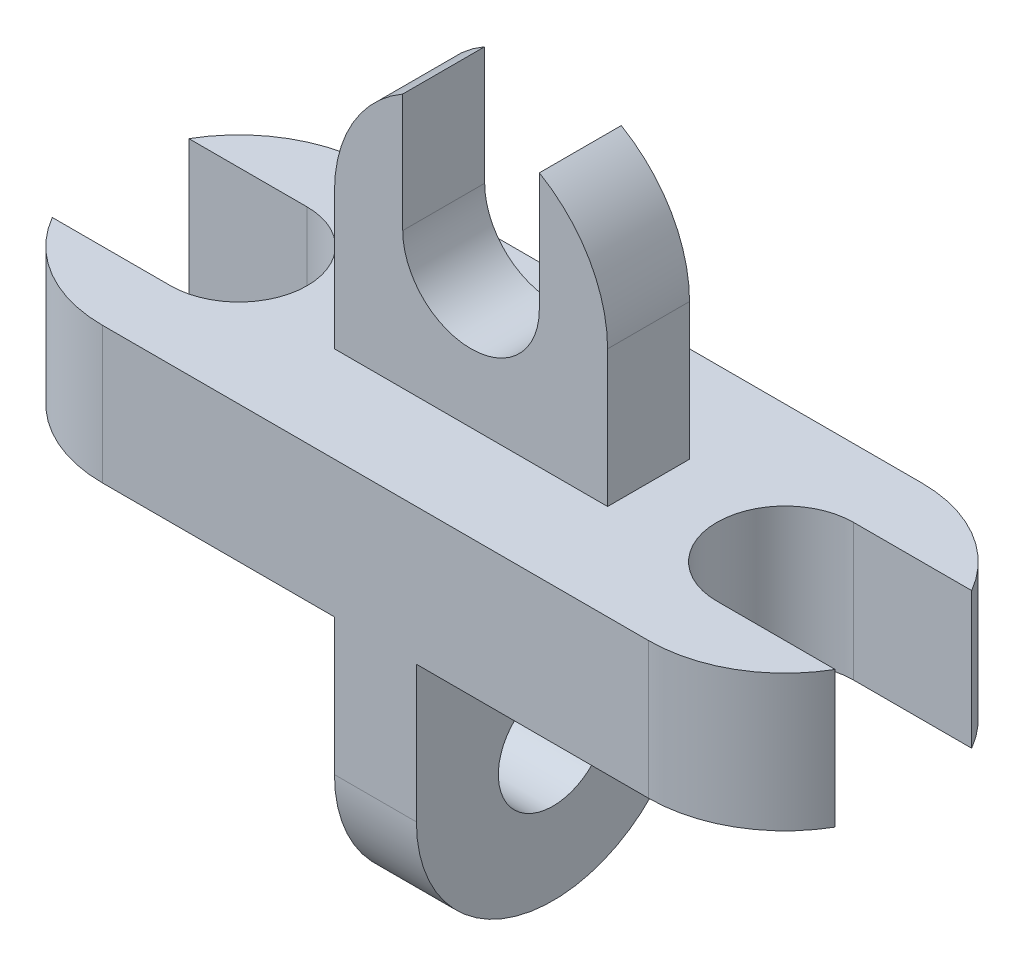
ISO-10303-21;
HEADER;
FILE_DESCRIPTION(('STEP AP214'),'2;1');
FILE_NAME('part.step','',(''),(''),'','','');
FILE_SCHEMA(('AUTOMOTIVE_DESIGN { 1 0 10303 214 1 1 1 1 }'));
ENDSEC;
DATA;
#1=APPLICATION_CONTEXT('core data for automotive mechanical design processes');
#2=APPLICATION_PROTOCOL_DEFINITION('international standard','automotive_design',2000,#1);
#3=PRODUCT_CONTEXT('',#1,'mechanical');
#4=PRODUCT('Part','Part','',(#3));
#5=PRODUCT_RELATED_PRODUCT_CATEGORY('part','',(#4));
#6=PRODUCT_DEFINITION_FORMATION('','',#4);
#7=PRODUCT_DEFINITION_CONTEXT('part definition',#1,'design');
#8=PRODUCT_DEFINITION('design','',#6,#7);
#9=PRODUCT_DEFINITION_SHAPE('','',#8);
#10=(LENGTH_UNIT() NAMED_UNIT(*) SI_UNIT(.MILLI.,.METRE.));
#11=(NAMED_UNIT(*) PLANE_ANGLE_UNIT() SI_UNIT($,.RADIAN.));
#12=(NAMED_UNIT(*) SI_UNIT($,.STERADIAN.) SOLID_ANGLE_UNIT());
#13=UNCERTAINTY_MEASURE_WITH_UNIT(LENGTH_MEASURE(1.E-05),#10,'distance_accuracy_value','');
#14=(GEOMETRIC_REPRESENTATION_CONTEXT(3) GLOBAL_UNCERTAINTY_ASSIGNED_CONTEXT((#13)) GLOBAL_UNIT_ASSIGNED_CONTEXT((#10,
#11,#12)) REPRESENTATION_CONTEXT('',''));
#15=CARTESIAN_POINT('',(0.,0.,0.));
#16=DIRECTION('',(0.,0.,1.));
#17=DIRECTION('',(1.,0.,0.));
#18=AXIS2_PLACEMENT_3D('',#15,#16,#17);
#19=CARTESIAN_POINT('',(-100.,-25.,0.));
#20=DIRECTION('',(0.,-1.,0.));
#21=DIRECTION('',(0.,0.,-1.));
#22=AXIS2_PLACEMENT_3D('',#19,#20,#21);
#23=PLANE('',#22);
#24=DIRECTION('',(1.,0.,0.));
#25=VECTOR('',#24,1.);
#26=CARTESIAN_POINT('',(100.,-25.,50.));
#27=LINE('',#26,#25);
#28=CARTESIAN_POINT('',(15.,-25.,50.));
#29=VERTEX_POINT('',#28);
#30=CARTESIAN_POINT('',(100.,-25.,50.));
#31=VERTEX_POINT('',#30);
#32=EDGE_CURVE('E208',#29,#31,#27,.T.);
#33=ORIENTED_EDGE('',*,*,#32,.F.);
#34=DIRECTION('',(0.,0.,-1.));
#35=VECTOR('',#34,1.);
#36=CARTESIAN_POINT('',(15.,-25.,50.));
#37=LINE('',#36,#35);
#38=CARTESIAN_POINT('',(15.,-25.,-50.));
#39=VERTEX_POINT('',#38);
#40=EDGE_CURVE('E195',#29,#39,#37,.T.);
#41=ORIENTED_EDGE('',*,*,#40,.T.);
#42=DIRECTION('',(-1.,0.,0.));
#43=VECTOR('',#42,1.);
#44=CARTESIAN_POINT('',(100.,-25.,-50.));
#45=LINE('',#44,#43);
#46=CARTESIAN_POINT('',(100.,-25.,-50.));
#47=VERTEX_POINT('',#46);
#48=EDGE_CURVE('E235',#47,#39,#45,.T.);
#49=ORIENTED_EDGE('',*,*,#48,.F.);
#50=CARTESIAN_POINT('',(100.,-25.,0.));
#51=DIRECTION('',(0.,1.,0.));
#52=DIRECTION('',(0.,0.,1.));
#53=AXIS2_PLACEMENT_3D('',#50,#51,#52);
#54=CIRCLE('',#53,50.);
#55=CARTESIAN_POINT('',(143.301270189222,-25.,-25.));
#56=VERTEX_POINT('',#55);
#57=EDGE_CURVE('E232',#56,#47,#54,.T.);
#58=ORIENTED_EDGE('',*,*,#57,.F.);
#59=DIRECTION('',(1.,0.,0.));
#60=VECTOR('',#59,1.);
#61=CARTESIAN_POINT('',(100.,-25.,-25.));
#62=LINE('',#61,#60);
#63=CARTESIAN_POINT('',(100.,-25.,-25.));
#64=VERTEX_POINT('',#63);
#65=EDGE_CURVE('E230',#64,#56,#62,.T.);
#66=ORIENTED_EDGE('',*,*,#65,.F.);
#67=CARTESIAN_POINT('',(100.,-25.,0.));
#68=DIRECTION('',(0.,-1.,0.));
#69=DIRECTION('',(0.,0.,1.));
#70=AXIS2_PLACEMENT_3D('',#67,#68,#69);
#71=CIRCLE('',#70,25.);
#72=CARTESIAN_POINT('',(100.,-25.,25.));
#73=VERTEX_POINT('',#72);
#74=EDGE_CURVE('E228',#73,#64,#71,.T.);
#75=ORIENTED_EDGE('',*,*,#74,.F.);
#76=DIRECTION('',(-1.,0.,0.));
#77=VECTOR('',#76,1.);
#78=CARTESIAN_POINT('',(100.,-25.,25.));
#79=LINE('',#78,#77);
#80=CARTESIAN_POINT('',(143.301270189222,-25.,25.));
#81=VERTEX_POINT('',#80);
#82=EDGE_CURVE('E226',#81,#73,#79,.T.);
#83=ORIENTED_EDGE('',*,*,#82,.F.);
#84=CARTESIAN_POINT('',(100.,-25.,0.));
#85=DIRECTION('',(0.,1.,0.));
#86=DIRECTION('',(0.,0.,1.));
#87=AXIS2_PLACEMENT_3D('',#84,#85,#86);
#88=CIRCLE('',#87,50.);
#89=EDGE_CURVE('E217',#31,#81,#88,.T.);
#90=ORIENTED_EDGE('',*,*,#89,.F.);
#91=EDGE_LOOP('',(#33,#41,#49,#58,#66,#75,#83,#90));
#92=FACE_BOUND('',#91,.T.);
#93=ADVANCED_FACE('F35',(#92),#23,.T.);
#94=CARTESIAN_POINT('',(50.,175.,15.));
#95=DIRECTION('',(-1.,0.,0.));
#96=DIRECTION('',(0.,0.,1.));
#97=AXIS2_PLACEMENT_3D('',#94,#95,#96);
#98=PLANE('',#97);
#99=DIRECTION('',(0.,0.,1.));
#100=VECTOR('',#99,1.);
#101=CARTESIAN_POINT('',(50.,75.,-135.));
#102=LINE('',#101,#100);
#103=CARTESIAN_POINT('',(50.,75.,-15.));
#104=VERTEX_POINT('',#103);
#105=CARTESIAN_POINT('',(50.,75.,15.));
#106=VERTEX_POINT('',#105);
#107=EDGE_CURVE('E353',#104,#106,#102,.T.);
#108=ORIENTED_EDGE('',*,*,#107,.T.);
#109=DIRECTION('',(0.,-1.,0.));
#110=VECTOR('',#109,1.);
#111=CARTESIAN_POINT('',(50.,175.,15.));
#112=LINE('',#111,#110);
#113=CARTESIAN_POINT('',(50.,25.,15.));
#114=VERTEX_POINT('',#113);
#115=EDGE_CURVE('E318',#106,#114,#112,.T.);
#116=ORIENTED_EDGE('',*,*,#115,.T.);
#117=DIRECTION('',(0.,0.,-1.));
#118=VECTOR('',#117,1.);
#119=CARTESIAN_POINT('',(50.,25.,15.));
#120=LINE('',#119,#118);
#121=CARTESIAN_POINT('',(50.,25.,-15.));
#122=VERTEX_POINT('',#121);
#123=EDGE_CURVE('E329',#114,#122,#120,.T.);
#124=ORIENTED_EDGE('',*,*,#123,.T.);
#125=DIRECTION('',(0.,-1.,0.));
#126=VECTOR('',#125,1.);
#127=CARTESIAN_POINT('',(50.,175.,-15.));
#128=LINE('',#127,#126);
#129=EDGE_CURVE('E290',#104,#122,#128,.T.);
#130=ORIENTED_EDGE('',*,*,#129,.F.);
#131=EDGE_LOOP('',(#108,#116,#124,#130));
#132=FACE_BOUND('',#131,.T.);
#133=ADVANCED_FACE('F415',(#132),#98,.F.);
#134=CARTESIAN_POINT('',(-100.,25.,0.));
#135=DIRECTION('',(0.,-1.,0.));
#136=DIRECTION('',(0.,0.,-1.));
#137=AXIS2_PLACEMENT_3D('',#134,#135,#136);
#138=PLANE('',#137);
#139=CARTESIAN_POINT('',(-100.,25.,0.));
#140=DIRECTION('',(0.,1.,0.));
#141=DIRECTION('',(0.,0.,-1.));
#142=AXIS2_PLACEMENT_3D('',#139,#140,#141);
#143=CIRCLE('',#142,50.);
#144=CARTESIAN_POINT('',(-100.,25.,-50.));
#145=VERTEX_POINT('',#144);
#146=CARTESIAN_POINT('',(-143.301270189222,25.,-25.));
#147=VERTEX_POINT('',#146);
#148=EDGE_CURVE('E237',#145,#147,#143,.T.);
#149=ORIENTED_EDGE('',*,*,#148,.T.);
#150=DIRECTION('',(1.,0.,0.));
#151=VECTOR('',#150,1.);
#152=CARTESIAN_POINT('',(-100.,25.,-25.));
#153=LINE('',#152,#151);
#154=CARTESIAN_POINT('',(-100.,25.,-25.));
#155=VERTEX_POINT('',#154);
#156=EDGE_CURVE('E309',#147,#155,#153,.T.);
#157=ORIENTED_EDGE('',*,*,#156,.T.);
#158=CARTESIAN_POINT('',(-100.,25.,0.));
#159=DIRECTION('',(0.,-1.,0.));
#160=DIRECTION('',(0.,0.,-1.));
#161=AXIS2_PLACEMENT_3D('',#158,#159,#160);
#162=CIRCLE('',#161,25.);
#163=CARTESIAN_POINT('',(-100.,25.,25.));
#164=VERTEX_POINT('',#163);
#165=EDGE_CURVE('E275',#155,#164,#162,.T.);
#166=ORIENTED_EDGE('',*,*,#165,.T.);
#167=DIRECTION('',(-1.,0.,0.));
#168=VECTOR('',#167,1.);
#169=CARTESIAN_POINT('',(-100.,25.,25.));
#170=LINE('',#169,#168);
#171=CARTESIAN_POINT('',(-143.301270189222,25.,25.));
#172=VERTEX_POINT('',#171);
#173=EDGE_CURVE('E306',#164,#172,#170,.T.);
#174=ORIENTED_EDGE('',*,*,#173,.T.);
#175=CARTESIAN_POINT('',(-100.,25.,0.));
#176=DIRECTION('',(0.,1.,0.));
#177=DIRECTION('',(0.,0.,-1.));
#178=AXIS2_PLACEMENT_3D('',#175,#176,#177);
#179=CIRCLE('',#178,50.);
#180=CARTESIAN_POINT('',(-100.,25.,50.));
#181=VERTEX_POINT('',#180);
#182=EDGE_CURVE('E304',#172,#181,#179,.T.);
#183=ORIENTED_EDGE('',*,*,#182,.T.);
#184=DIRECTION('',(1.,0.,0.));
#185=VECTOR('',#184,1.);
#186=CARTESIAN_POINT('',(100.,25.,50.));
#187=LINE('',#186,#185);
#188=CARTESIAN_POINT('',(100.,25.,50.));
#189=VERTEX_POINT('',#188);
#190=EDGE_CURVE('E302',#181,#189,#187,.T.);
#191=ORIENTED_EDGE('',*,*,#190,.T.);
#192=CARTESIAN_POINT('',(100.,25.,0.));
#193=DIRECTION('',(0.,1.,0.));
#194=DIRECTION('',(0.,0.,1.));
#195=AXIS2_PLACEMENT_3D('',#192,#193,#194);
#196=CIRCLE('',#195,50.);
#197=CARTESIAN_POINT('',(143.301270189222,25.,25.));
#198=VERTEX_POINT('',#197);
#199=EDGE_CURVE('E300',#189,#198,#196,.T.);
#200=ORIENTED_EDGE('',*,*,#199,.T.);
#201=DIRECTION('',(-1.,0.,0.));
#202=VECTOR('',#201,1.);
#203=CARTESIAN_POINT('',(100.,25.,25.));
#204=LINE('',#203,#202);
#205=CARTESIAN_POINT('',(100.,25.,25.));
#206=VERTEX_POINT('',#205);
#207=EDGE_CURVE('E298',#198,#206,#204,.T.);
#208=ORIENTED_EDGE('',*,*,#207,.T.);
#209=CARTESIAN_POINT('',(100.,25.,0.));
#210=DIRECTION('',(0.,-1.,0.));
#211=DIRECTION('',(0.,0.,1.));
#212=AXIS2_PLACEMENT_3D('',#209,#210,#211);
#213=CIRCLE('',#212,25.);
#214=CARTESIAN_POINT('',(100.,25.,-25.));
#215=VERTEX_POINT('',#214);
#216=EDGE_CURVE('E296',#206,#215,#213,.T.);
#217=ORIENTED_EDGE('',*,*,#216,.T.);
#218=DIRECTION('',(1.,0.,0.));
#219=VECTOR('',#218,1.);
#220=CARTESIAN_POINT('',(100.,25.,-25.));
#221=LINE('',#220,#219);
#222=CARTESIAN_POINT('',(143.301270189222,25.,-25.));
#223=VERTEX_POINT('',#222);
#224=EDGE_CURVE('E294',#215,#223,#221,.T.);
#225=ORIENTED_EDGE('',*,*,#224,.T.);
#226=CARTESIAN_POINT('',(100.,25.,0.));
#227=DIRECTION('',(0.,1.,0.));
#228=DIRECTION('',(0.,0.,1.));
#229=AXIS2_PLACEMENT_3D('',#226,#227,#228);
#230=CIRCLE('',#229,50.);
#231=CARTESIAN_POINT('',(100.,25.,-50.));
#232=VERTEX_POINT('',#231);
#233=EDGE_CURVE('E292',#223,#232,#230,.T.);
#234=ORIENTED_EDGE('',*,*,#233,.T.);
#235=DIRECTION('',(-1.,0.,0.));
#236=VECTOR('',#235,1.);
#237=CARTESIAN_POINT('',(100.,25.,-50.));
#238=LINE('',#237,#236);
#239=EDGE_CURVE('E242',#232,#145,#238,.T.);
#240=ORIENTED_EDGE('',*,*,#239,.T.);
#241=EDGE_LOOP('',(#149,#157,#166,#174,#183,#191,#200,#208,#217,#225,#234,#240));
#242=FACE_BOUND('',#241,.T.);
#243=ORIENTED_EDGE('',*,*,#123,.F.);
#244=DIRECTION('',(1.,0.,0.));
#245=VECTOR('',#244,1.);
#246=CARTESIAN_POINT('',(-50.,25.,15.));
#247=LINE('',#246,#245);
#248=CARTESIAN_POINT('',(-50.,25.,15.));
#249=VERTEX_POINT('',#248);
#250=EDGE_CURVE('E320',#249,#114,#247,.T.);
#251=ORIENTED_EDGE('',*,*,#250,.F.);
#252=DIRECTION('',(0.,0.,1.));
#253=VECTOR('',#252,1.);
#254=CARTESIAN_POINT('',(-50.,25.,15.));
#255=LINE('',#254,#253);
#256=CARTESIAN_POINT('',(-50.,25.,-15.));
#257=VERTEX_POINT('',#256);
#258=EDGE_CURVE('E323',#257,#249,#255,.T.);
#259=ORIENTED_EDGE('',*,*,#258,.F.);
#260=DIRECTION('',(-1.,0.,0.));
#261=VECTOR('',#260,1.);
#262=CARTESIAN_POINT('',(-50.,25.,-15.));
#263=LINE('',#262,#261);
#264=EDGE_CURVE('E326',#122,#257,#263,.T.);
#265=ORIENTED_EDGE('',*,*,#264,.F.);
#266=EDGE_LOOP('',(#243,#251,#259,#265));
#267=FACE_BOUND('',#266,.T.);
#268=ADVANCED_FACE('F420',(#242,#267),#138,.F.);
#269=CARTESIAN_POINT('',(-100.,25.,0.));
#270=DIRECTION('',(0.,-1.,0.));
#271=DIRECTION('',(0.,0.,-1.));
#272=AXIS2_PLACEMENT_3D('',#269,#270,#271);
#273=CYLINDRICAL_SURFACE('',#272,50.);
#274=CARTESIAN_POINT('',(-100.,-25.,0.));
#275=DIRECTION('',(0.,1.,0.));
#276=DIRECTION('',(0.,0.,-1.));
#277=AXIS2_PLACEMENT_3D('',#274,#275,#276);
#278=CIRCLE('',#277,50.);
#279=CARTESIAN_POINT('',(-100.,-25.,-50.));
#280=VERTEX_POINT('',#279);
#281=CARTESIAN_POINT('',(-143.301270189222,-25.,-25.));
#282=VERTEX_POINT('',#281);
#283=EDGE_CURVE('E285',#280,#282,#278,.T.);
#284=ORIENTED_EDGE('',*,*,#283,.T.);
#285=DIRECTION('',(0.,-1.,0.));
#286=VECTOR('',#285,1.);
#287=CARTESIAN_POINT('',(-143.301270189222,25.,-25.));
#288=LINE('',#287,#286);
#289=EDGE_CURVE('E11',#147,#282,#288,.T.);
#290=ORIENTED_EDGE('',*,*,#289,.F.);
#291=ORIENTED_EDGE('',*,*,#148,.F.);
#292=DIRECTION('',(0.,-1.,0.));
#293=VECTOR('',#292,1.);
#294=CARTESIAN_POINT('',(-100.,25.,-50.));
#295=LINE('',#294,#293);
#296=EDGE_CURVE('E238',#145,#280,#295,.T.);
#297=ORIENTED_EDGE('',*,*,#296,.T.);
#298=EDGE_LOOP('',(#284,#290,#291,#297));
#299=FACE_BOUND('',#298,.T.);
#300=ADVANCED_FACE('F37',(#299),#273,.T.);
#301=CARTESIAN_POINT('',(-100.,25.,-25.));
#302=DIRECTION('',(0.,0.,-1.));
#303=DIRECTION('',(-1.,0.,0.));
#304=AXIS2_PLACEMENT_3D('',#301,#302,#303);
#305=PLANE('',#304);
#306=DIRECTION('',(1.,0.,0.));
#307=VECTOR('',#306,1.);
#308=CARTESIAN_POINT('',(-100.,-25.,-25.));
#309=LINE('',#308,#307);
#310=CARTESIAN_POINT('',(-100.,-25.,-25.));
#311=VERTEX_POINT('',#310);
#312=EDGE_CURVE('E282',#282,#311,#309,.T.);
#313=ORIENTED_EDGE('',*,*,#312,.T.);
#314=DIRECTION('',(0.,-1.,0.));
#315=VECTOR('',#314,1.);
#316=CARTESIAN_POINT('',(-100.,25.,-25.));
#317=LINE('',#316,#315);
#318=EDGE_CURVE('E43',#155,#311,#317,.T.);
#319=ORIENTED_EDGE('',*,*,#318,.F.);
#320=ORIENTED_EDGE('',*,*,#156,.F.);
#321=ORIENTED_EDGE('',*,*,#289,.T.);
#322=EDGE_LOOP('',(#313,#319,#320,#321));
#323=FACE_BOUND('',#322,.T.);
#324=ADVANCED_FACE('F470',(#323),#305,.F.);
#325=CARTESIAN_POINT('',(-100.,25.,0.));
#326=DIRECTION('',(0.,-1.,0.));
#327=DIRECTION('',(0.,0.,-1.));
#328=AXIS2_PLACEMENT_3D('',#325,#326,#327);
#329=CYLINDRICAL_SURFACE('',#328,25.);
#330=CARTESIAN_POINT('',(-100.,-25.,0.));
#331=DIRECTION('',(0.,-1.,0.));
#332=DIRECTION('',(0.,0.,-1.));
#333=AXIS2_PLACEMENT_3D('',#330,#331,#332);
#334=CIRCLE('',#333,25.);
#335=CARTESIAN_POINT('',(-100.,-25.,25.));
#336=VERTEX_POINT('',#335);
#337=EDGE_CURVE('E274',#311,#336,#334,.T.);
#338=ORIENTED_EDGE('',*,*,#337,.T.);
#339=DIRECTION('',(0.,-1.,0.));
#340=VECTOR('',#339,1.);
#341=CARTESIAN_POINT('',(-100.,25.,25.));
#342=LINE('',#341,#340);
#343=EDGE_CURVE('E265',#164,#336,#342,.T.);
#344=ORIENTED_EDGE('',*,*,#343,.F.);
#345=ORIENTED_EDGE('',*,*,#165,.F.);
#346=ORIENTED_EDGE('',*,*,#318,.T.);
#347=EDGE_LOOP('',(#338,#344,#345,#346));
#348=FACE_BOUND('',#347,.T.);
#349=ADVANCED_FACE('F272',(#348),#329,.F.);
#350=CARTESIAN_POINT('',(-100.,25.,25.));
#351=DIRECTION('',(0.,0.,1.));
#352=DIRECTION('',(1.,0.,0.));
#353=AXIS2_PLACEMENT_3D('',#350,#351,#352);
#354=PLANE('',#353);
#355=DIRECTION('',(-1.,0.,0.));
#356=VECTOR('',#355,1.);
#357=CARTESIAN_POINT('',(-100.,-25.,25.));
#358=LINE('',#357,#356);
#359=CARTESIAN_POINT('',(-143.301270189222,-25.,25.));
#360=VERTEX_POINT('',#359);
#361=EDGE_CURVE('E221',#336,#360,#358,.T.);
#362=ORIENTED_EDGE('',*,*,#361,.T.);
#363=DIRECTION('',(0.,-1.,0.));
#364=VECTOR('',#363,1.);
#365=CARTESIAN_POINT('',(-143.301270189222,25.,25.));
#366=LINE('',#365,#364);
#367=EDGE_CURVE('E262',#172,#360,#366,.T.);
#368=ORIENTED_EDGE('',*,*,#367,.F.);
#369=ORIENTED_EDGE('',*,*,#173,.F.);
#370=ORIENTED_EDGE('',*,*,#343,.T.);
#371=EDGE_LOOP('',(#362,#368,#369,#370));
#372=FACE_BOUND('',#371,.T.);
#373=ADVANCED_FACE('F464',(#372),#354,.F.);
#374=CARTESIAN_POINT('',(-100.,25.,0.));
#375=DIRECTION('',(0.,-1.,0.));
#376=DIRECTION('',(0.,0.,-1.));
#377=AXIS2_PLACEMENT_3D('',#374,#375,#376);
#378=CYLINDRICAL_SURFACE('',#377,50.);
#379=CARTESIAN_POINT('',(-100.,-25.,0.));
#380=DIRECTION('',(0.,1.,0.));
#381=DIRECTION('',(0.,0.,-1.));
#382=AXIS2_PLACEMENT_3D('',#379,#380,#381);
#383=CIRCLE('',#382,50.);
#384=CARTESIAN_POINT('',(-100.,-25.,50.));
#385=VERTEX_POINT('',#384);
#386=EDGE_CURVE('E219',#360,#385,#383,.T.);
#387=ORIENTED_EDGE('',*,*,#386,.T.);
#388=DIRECTION('',(0.,-1.,0.));
#389=VECTOR('',#388,1.);
#390=CARTESIAN_POINT('',(-100.,25.,50.));
#391=LINE('',#390,#389);
#392=EDGE_CURVE('E259',#181,#385,#391,.T.);
#393=ORIENTED_EDGE('',*,*,#392,.F.);
#394=ORIENTED_EDGE('',*,*,#182,.F.);
#395=ORIENTED_EDGE('',*,*,#367,.T.);
#396=EDGE_LOOP('',(#387,#393,#394,#395));
#397=FACE_BOUND('',#396,.T.);
#398=ADVANCED_FACE('F461',(#397),#378,.T.);
#399=CARTESIAN_POINT('',(100.,25.,50.));
#400=DIRECTION('',(0.,0.,-1.));
#401=DIRECTION('',(-1.,0.,0.));
#402=AXIS2_PLACEMENT_3D('',#399,#400,#401);
#403=PLANE('',#402);
#404=CARTESIAN_POINT('',(-15.,-25.,50.));
#405=VERTEX_POINT('',#404);
#406=EDGE_CURVE('E218',#385,#405,#27,.T.);
#407=ORIENTED_EDGE('',*,*,#406,.T.);
#408=DIRECTION('',(0.,1.,0.));
#409=VECTOR('',#408,1.);
#410=CARTESIAN_POINT('',(-15.,-74.998729810778,50.));
#411=LINE('',#410,#409);
#412=CARTESIAN_POINT('',(-15.,-74.998729810778,50.));
#413=VERTEX_POINT('',#412);
#414=EDGE_CURVE('E383',#413,#405,#411,.T.);
#415=ORIENTED_EDGE('',*,*,#414,.F.);
#416=DIRECTION('',(-1.,0.,0.));
#417=VECTOR('',#416,1.);
#418=CARTESIAN_POINT('',(15.,-74.998729810778,50.));
#419=LINE('',#418,#417);
#420=CARTESIAN_POINT('',(15.,-74.998729810778,50.));
#421=VERTEX_POINT('',#420);
#422=EDGE_CURVE('E211',#421,#413,#419,.T.);
#423=ORIENTED_EDGE('',*,*,#422,.F.);
#424=DIRECTION('',(0.,1.,0.));
#425=VECTOR('',#424,1.);
#426=CARTESIAN_POINT('',(15.,-74.998729810778,50.));
#427=LINE('',#426,#425);
#428=EDGE_CURVE('E198',#421,#29,#427,.T.);
#429=ORIENTED_EDGE('',*,*,#428,.T.);
#430=ORIENTED_EDGE('',*,*,#32,.T.);
#431=DIRECTION('',(0.,-1.,0.));
#432=VECTOR('',#431,1.);
#433=CARTESIAN_POINT('',(100.,25.,50.));
#434=LINE('',#433,#432);
#435=EDGE_CURVE('E257',#189,#31,#434,.T.);
#436=ORIENTED_EDGE('',*,*,#435,.F.);
#437=ORIENTED_EDGE('',*,*,#190,.F.);
#438=ORIENTED_EDGE('',*,*,#392,.T.);
#439=EDGE_LOOP('',(#407,#415,#423,#429,#430,#436,#437,#438));
#440=FACE_BOUND('',#439,.T.);
#441=ADVANCED_FACE('F206',(#440),#403,.F.);
#442=CARTESIAN_POINT('',(100.,25.,0.));
#443=DIRECTION('',(0.,-1.,0.));
#444=DIRECTION('',(0.,0.,-1.));
#445=AXIS2_PLACEMENT_3D('',#442,#443,#444);
#446=CYLINDRICAL_SURFACE('',#445,50.);
#447=ORIENTED_EDGE('',*,*,#89,.T.);
#448=DIRECTION('',(0.,-1.,0.));
#449=VECTOR('',#448,1.);
#450=CARTESIAN_POINT('',(143.301270189222,25.,25.));
#451=LINE('',#450,#449);
#452=EDGE_CURVE('E254',#198,#81,#451,.T.);
#453=ORIENTED_EDGE('',*,*,#452,.F.);
#454=ORIENTED_EDGE('',*,*,#199,.F.);
#455=ORIENTED_EDGE('',*,*,#435,.T.);
#456=EDGE_LOOP('',(#447,#453,#454,#455));
#457=FACE_BOUND('',#456,.T.);
#458=ADVANCED_FACE('F454',(#457),#446,.T.);
#459=CARTESIAN_POINT('',(100.,25.,25.));
#460=DIRECTION('',(0.,0.,1.));
#461=DIRECTION('',(1.,0.,0.));
#462=AXIS2_PLACEMENT_3D('',#459,#460,#461);
#463=PLANE('',#462);
#464=ORIENTED_EDGE('',*,*,#82,.T.);
#465=DIRECTION('',(0.,-1.,0.));
#466=VECTOR('',#465,1.);
#467=CARTESIAN_POINT('',(100.,25.,25.));
#468=LINE('',#467,#466);
#469=EDGE_CURVE('E251',#206,#73,#468,.T.);
#470=ORIENTED_EDGE('',*,*,#469,.F.);
#471=ORIENTED_EDGE('',*,*,#207,.F.);
#472=ORIENTED_EDGE('',*,*,#452,.T.);
#473=EDGE_LOOP('',(#464,#470,#471,#472));
#474=FACE_BOUND('',#473,.T.);
#475=ADVANCED_FACE('F450',(#474),#463,.F.);
#476=CARTESIAN_POINT('',(100.,25.,0.));
#477=DIRECTION('',(0.,-1.,0.));
#478=DIRECTION('',(0.,0.,-1.));
#479=AXIS2_PLACEMENT_3D('',#476,#477,#478);
#480=CYLINDRICAL_SURFACE('',#479,25.);
#481=ORIENTED_EDGE('',*,*,#74,.T.);
#482=DIRECTION('',(0.,-1.,0.));
#483=VECTOR('',#482,1.);
#484=CARTESIAN_POINT('',(100.,25.,-25.));
#485=LINE('',#484,#483);
#486=EDGE_CURVE('E248',#215,#64,#485,.T.);
#487=ORIENTED_EDGE('',*,*,#486,.F.);
#488=ORIENTED_EDGE('',*,*,#216,.F.);
#489=ORIENTED_EDGE('',*,*,#469,.T.);
#490=EDGE_LOOP('',(#481,#487,#488,#489));
#491=FACE_BOUND('',#490,.T.);
#492=ADVANCED_FACE('F446',(#491),#480,.F.);
#493=CARTESIAN_POINT('',(100.,25.,-25.));
#494=DIRECTION('',(0.,0.,-1.));
#495=DIRECTION('',(-1.,0.,0.));
#496=AXIS2_PLACEMENT_3D('',#493,#494,#495);
#497=PLANE('',#496);
#498=ORIENTED_EDGE('',*,*,#65,.T.);
#499=DIRECTION('',(0.,-1.,0.));
#500=VECTOR('',#499,1.);
#501=CARTESIAN_POINT('',(143.301270189222,25.,-25.));
#502=LINE('',#501,#500);
#503=EDGE_CURVE('E245',#223,#56,#502,.T.);
#504=ORIENTED_EDGE('',*,*,#503,.F.);
#505=ORIENTED_EDGE('',*,*,#224,.F.);
#506=ORIENTED_EDGE('',*,*,#486,.T.);
#507=EDGE_LOOP('',(#498,#504,#505,#506));
#508=FACE_BOUND('',#507,.T.);
#509=ADVANCED_FACE('F440',(#508),#497,.F.);
#510=CARTESIAN_POINT('',(100.,25.,0.));
#511=DIRECTION('',(0.,-1.,0.));
#512=DIRECTION('',(0.,0.,-1.));
#513=AXIS2_PLACEMENT_3D('',#510,#511,#512);
#514=CYLINDRICAL_SURFACE('',#513,50.);
#515=ORIENTED_EDGE('',*,*,#57,.T.);
#516=DIRECTION('',(0.,-1.,0.));
#517=VECTOR('',#516,1.);
#518=CARTESIAN_POINT('',(100.,25.,-50.));
#519=LINE('',#518,#517);
#520=EDGE_CURVE('E241',#232,#47,#519,.T.);
#521=ORIENTED_EDGE('',*,*,#520,.F.);
#522=ORIENTED_EDGE('',*,*,#233,.F.);
#523=ORIENTED_EDGE('',*,*,#503,.T.);
#524=EDGE_LOOP('',(#515,#521,#522,#523));
#525=FACE_BOUND('',#524,.T.);
#526=ADVANCED_FACE('F435',(#525),#514,.T.);
#527=CARTESIAN_POINT('',(100.,25.,-50.));
#528=DIRECTION('',(0.,0.,1.));
#529=DIRECTION('',(1.,0.,0.));
#530=AXIS2_PLACEMENT_3D('',#527,#528,#529);
#531=PLANE('',#530);
#532=ORIENTED_EDGE('',*,*,#48,.T.);
#533=DIRECTION('',(0.,1.,0.));
#534=VECTOR('',#533,1.);
#535=CARTESIAN_POINT('',(15.,-74.998729810778,-50.));
#536=LINE('',#535,#534);
#537=CARTESIAN_POINT('',(15.,-74.998729810778,-50.));
#538=VERTEX_POINT('',#537);
#539=EDGE_CURVE('E50',#538,#39,#536,.T.);
#540=ORIENTED_EDGE('',*,*,#539,.F.);
#541=DIRECTION('',(-1.,0.,0.));
#542=VECTOR('',#541,1.);
#543=CARTESIAN_POINT('',(15.,-74.998729810778,-50.));
#544=LINE('',#543,#542);
#545=CARTESIAN_POINT('',(-15.,-74.998729810778,-50.));
#546=VERTEX_POINT('',#545);
#547=EDGE_CURVE('E372',#538,#546,#544,.T.);
#548=ORIENTED_EDGE('',*,*,#547,.T.);
#549=DIRECTION('',(0.,1.,0.));
#550=VECTOR('',#549,1.);
#551=CARTESIAN_POINT('',(-15.,-74.998729810778,-50.));
#552=LINE('',#551,#550);
#553=CARTESIAN_POINT('',(-15.,-25.,-50.));
#554=VERTEX_POINT('',#553);
#555=EDGE_CURVE('E378',#546,#554,#552,.T.);
#556=ORIENTED_EDGE('',*,*,#555,.T.);
#557=EDGE_CURVE('E234',#554,#280,#45,.T.);
#558=ORIENTED_EDGE('',*,*,#557,.T.);
#559=ORIENTED_EDGE('',*,*,#296,.F.);
#560=ORIENTED_EDGE('',*,*,#239,.F.);
#561=ORIENTED_EDGE('',*,*,#520,.T.);
#562=EDGE_LOOP('',(#532,#540,#548,#556,#558,#559,#560,#561));
#563=FACE_BOUND('',#562,.T.);
#564=ADVANCED_FACE('F427',(#563),#531,.F.);
#565=DIRECTION('',(0.,0.,-1.));
#566=VECTOR('',#565,1.);
#567=CARTESIAN_POINT('',(-15.,-25.,-25.));
#568=LINE('',#567,#566);
#569=EDGE_CURVE('E380',#405,#554,#568,.T.);
#570=ORIENTED_EDGE('',*,*,#569,.F.);
#571=ORIENTED_EDGE('',*,*,#406,.F.);
#572=ORIENTED_EDGE('',*,*,#386,.F.);
#573=ORIENTED_EDGE('',*,*,#361,.F.);
#574=ORIENTED_EDGE('',*,*,#337,.F.);
#575=ORIENTED_EDGE('',*,*,#312,.F.);
#576=ORIENTED_EDGE('',*,*,#283,.F.);
#577=ORIENTED_EDGE('',*,*,#557,.F.);
#578=EDGE_LOOP('',(#570,#571,#572,#573,#574,#575,#576,#577));
#579=FACE_BOUND('',#578,.T.);
#580=ADVANCED_FACE('F280',(#579),#23,.T.);
#581=CARTESIAN_POINT('',(-50.,175.,-15.));
#582=DIRECTION('',(0.,0.,1.));
#583=DIRECTION('',(1.,0.,0.));
#584=AXIS2_PLACEMENT_3D('',#581,#582,#583);
#585=PLANE('',#584);
#586=DIRECTION('',(0.,-1.,0.));
#587=VECTOR('',#586,1.);
#588=CARTESIAN_POINT('',(-50.,175.,-15.));
#589=LINE('',#588,#587);
#590=CARTESIAN_POINT('',(-50.,75.,-15.));
#591=VERTEX_POINT('',#590);
#592=EDGE_CURVE('E314',#591,#257,#589,.T.);
#593=ORIENTED_EDGE('',*,*,#592,.F.);
#594=CARTESIAN_POINT('',(0.,75.,-15.));
#595=DIRECTION('',(0.,0.,1.));
#596=DIRECTION('',(1.,0.,0.));
#597=AXIS2_PLACEMENT_3D('',#594,#595,#596);
#598=CIRCLE('',#597,50.);
#599=CARTESIAN_POINT('',(-25.,118.301270189222,-15.));
#600=VERTEX_POINT('',#599);
#601=EDGE_CURVE('E338',#591,#600,#598,.F.);
#602=ORIENTED_EDGE('',*,*,#601,.T.);
#603=DIRECTION('',(0.,-1.,0.));
#604=VECTOR('',#603,1.);
#605=CARTESIAN_POINT('',(-25.,175.,-15.));
#606=LINE('',#605,#604);
#607=CARTESIAN_POINT('',(-25.,75.,-15.));
#608=VERTEX_POINT('',#607);
#609=EDGE_CURVE('E335',#600,#608,#606,.T.);
#610=ORIENTED_EDGE('',*,*,#609,.T.);
#611=CARTESIAN_POINT('',(0.,75.,-15.));
#612=DIRECTION('',(0.,0.,1.));
#613=DIRECTION('',(1.,0.,0.));
#614=AXIS2_PLACEMENT_3D('',#611,#612,#613);
#615=CIRCLE('',#614,25.);
#616=CARTESIAN_POINT('',(25.,75.,-15.));
#617=VERTEX_POINT('',#616);
#618=EDGE_CURVE('E332',#608,#617,#615,.T.);
#619=ORIENTED_EDGE('',*,*,#618,.T.);
#620=DIRECTION('',(0.,1.,0.));
#621=VECTOR('',#620,1.);
#622=CARTESIAN_POINT('',(25.,175.,-15.));
#623=LINE('',#622,#621);
#624=CARTESIAN_POINT('',(25.,118.301270189222,-15.));
#625=VERTEX_POINT('',#624);
#626=EDGE_CURVE('E344',#617,#625,#623,.T.);
#627=ORIENTED_EDGE('',*,*,#626,.T.);
#628=CARTESIAN_POINT('',(0.,75.,-15.));
#629=DIRECTION('',(0.,0.,1.));
#630=DIRECTION('',(1.,0.,0.));
#631=AXIS2_PLACEMENT_3D('',#628,#629,#630);
#632=CIRCLE('',#631,50.);
#633=EDGE_CURVE('E341',#625,#104,#632,.F.);
#634=ORIENTED_EDGE('',*,*,#633,.T.);
#635=ORIENTED_EDGE('',*,*,#129,.T.);
#636=ORIENTED_EDGE('',*,*,#264,.T.);
#637=EDGE_LOOP('',(#593,#602,#610,#619,#627,#634,#635,#636));
#638=FACE_BOUND('',#637,.T.);
#639=ADVANCED_FACE('F426',(#638),#585,.F.);
#640=CARTESIAN_POINT('',(-50.,175.,15.));
#641=DIRECTION('',(1.,0.,0.));
#642=DIRECTION('',(0.,0.,-1.));
#643=AXIS2_PLACEMENT_3D('',#640,#641,#642);
#644=PLANE('',#643);
#645=DIRECTION('',(0.,-1.,0.));
#646=VECTOR('',#645,1.);
#647=CARTESIAN_POINT('',(-50.,175.,15.));
#648=LINE('',#647,#646);
#649=CARTESIAN_POINT('',(-50.,75.,15.));
#650=VERTEX_POINT('',#649);
#651=EDGE_CURVE('E316',#650,#249,#648,.T.);
#652=ORIENTED_EDGE('',*,*,#651,.F.);
#653=DIRECTION('',(0.,0.,1.));
#654=VECTOR('',#653,1.);
#655=CARTESIAN_POINT('',(-50.,75.,-135.));
#656=LINE('',#655,#654);
#657=EDGE_CURVE('E356',#591,#650,#656,.T.);
#658=ORIENTED_EDGE('',*,*,#657,.F.);
#659=ORIENTED_EDGE('',*,*,#592,.T.);
#660=ORIENTED_EDGE('',*,*,#258,.T.);
#661=EDGE_LOOP('',(#652,#658,#659,#660));
#662=FACE_BOUND('',#661,.T.);
#663=ADVANCED_FACE('F432',(#662),#644,.F.);
#664=CARTESIAN_POINT('',(-50.,175.,15.));
#665=DIRECTION('',(0.,0.,-1.));
#666=DIRECTION('',(-1.,0.,0.));
#667=AXIS2_PLACEMENT_3D('',#664,#665,#666);
#668=PLANE('',#667);
#669=DIRECTION('',(0.,-1.,0.));
#670=VECTOR('',#669,1.);
#671=CARTESIAN_POINT('',(-25.,75.,15.));
#672=LINE('',#671,#670);
#673=CARTESIAN_POINT('',(-25.,118.301270189222,15.));
#674=VERTEX_POINT('',#673);
#675=CARTESIAN_POINT('',(-25.,75.,15.));
#676=VERTEX_POINT('',#675);
#677=EDGE_CURVE('E351',#674,#676,#672,.T.);
#678=ORIENTED_EDGE('',*,*,#677,.F.);
#679=CARTESIAN_POINT('',(0.,75.,15.));
#680=DIRECTION('',(0.,0.,-1.));
#681=DIRECTION('',(1.,0.,0.));
#682=AXIS2_PLACEMENT_3D('',#679,#680,#681);
#683=CIRCLE('',#682,50.);
#684=EDGE_CURVE('E363',#650,#674,#683,.T.);
#685=ORIENTED_EDGE('',*,*,#684,.F.);
#686=ORIENTED_EDGE('',*,*,#651,.T.);
#687=ORIENTED_EDGE('',*,*,#250,.T.);
#688=ORIENTED_EDGE('',*,*,#115,.F.);
#689=CARTESIAN_POINT('',(0.,75.,15.));
#690=DIRECTION('',(0.,0.,-1.));
#691=DIRECTION('',(1.,0.,0.));
#692=AXIS2_PLACEMENT_3D('',#689,#690,#691);
#693=CIRCLE('',#692,50.);
#694=CARTESIAN_POINT('',(25.,118.301270189222,15.));
#695=VERTEX_POINT('',#694);
#696=EDGE_CURVE('E366',#695,#106,#693,.T.);
#697=ORIENTED_EDGE('',*,*,#696,.F.);
#698=DIRECTION('',(0.,1.,0.));
#699=VECTOR('',#698,1.);
#700=CARTESIAN_POINT('',(25.,75.,15.));
#701=LINE('',#700,#699);
#702=CARTESIAN_POINT('',(25.,75.,15.));
#703=VERTEX_POINT('',#702);
#704=EDGE_CURVE('E368',#703,#695,#701,.T.);
#705=ORIENTED_EDGE('',*,*,#704,.F.);
#706=CARTESIAN_POINT('',(0.,75.,15.));
#707=DIRECTION('',(0.,0.,1.));
#708=DIRECTION('',(1.,0.,0.));
#709=AXIS2_PLACEMENT_3D('',#706,#707,#708);
#710=CIRCLE('',#709,25.);
#711=EDGE_CURVE('E58',#676,#703,#710,.T.);
#712=ORIENTED_EDGE('',*,*,#711,.F.);
#713=EDGE_LOOP('',(#678,#685,#686,#687,#688,#697,#705,#712));
#714=FACE_BOUND('',#713,.T.);
#715=ADVANCED_FACE('F514',(#714),#668,.F.);
#716=CARTESIAN_POINT('',(0.,75.,-135.));
#717=DIRECTION('',(0.,0.,1.));
#718=DIRECTION('',(1.,0.,0.));
#719=AXIS2_PLACEMENT_3D('',#716,#717,#718);
#720=CYLINDRICAL_SURFACE('',#719,25.);
#721=DIRECTION('',(0.,0.,1.));
#722=VECTOR('',#721,1.);
#723=CARTESIAN_POINT('',(-25.,75.,-135.));
#724=LINE('',#723,#722);
#725=EDGE_CURVE('E347',#608,#676,#724,.T.);
#726=ORIENTED_EDGE('',*,*,#725,.T.);
#727=ORIENTED_EDGE('',*,*,#711,.T.);
#728=DIRECTION('',(0.,0.,1.));
#729=VECTOR('',#728,1.);
#730=CARTESIAN_POINT('',(25.,75.,-135.));
#731=LINE('',#730,#729);
#732=EDGE_CURVE('E348',#617,#703,#731,.T.);
#733=ORIENTED_EDGE('',*,*,#732,.F.);
#734=ORIENTED_EDGE('',*,*,#618,.F.);
#735=EDGE_LOOP('',(#726,#727,#733,#734));
#736=FACE_BOUND('',#735,.T.);
#737=ADVANCED_FACE('F526',(#736),#720,.F.);
#738=CARTESIAN_POINT('',(-25.,75.,-135.));
#739=DIRECTION('',(-1.,0.,0.));
#740=DIRECTION('',(0.,0.,1.));
#741=AXIS2_PLACEMENT_3D('',#738,#739,#740);
#742=PLANE('',#741);
#743=DIRECTION('',(0.,0.,1.));
#744=VECTOR('',#743,1.);
#745=CARTESIAN_POINT('',(-25.,118.301270189222,-135.));
#746=LINE('',#745,#744);
#747=EDGE_CURVE('E358',#600,#674,#746,.T.);
#748=ORIENTED_EDGE('',*,*,#747,.T.);
#749=ORIENTED_EDGE('',*,*,#677,.T.);
#750=ORIENTED_EDGE('',*,*,#725,.F.);
#751=ORIENTED_EDGE('',*,*,#609,.F.);
#752=EDGE_LOOP('',(#748,#749,#750,#751));
#753=FACE_BOUND('',#752,.T.);
#754=ADVANCED_FACE('F530',(#753),#742,.F.);
#755=CARTESIAN_POINT('',(0.,75.,-135.));
#756=DIRECTION('',(0.,0.,1.));
#757=DIRECTION('',(1.,0.,0.));
#758=AXIS2_PLACEMENT_3D('',#755,#756,#757);
#759=CYLINDRICAL_SURFACE('',#758,50.);
#760=ORIENTED_EDGE('',*,*,#657,.T.);
#761=ORIENTED_EDGE('',*,*,#684,.T.);
#762=ORIENTED_EDGE('',*,*,#747,.F.);
#763=ORIENTED_EDGE('',*,*,#601,.F.);
#764=EDGE_LOOP('',(#760,#761,#762,#763));
#765=FACE_BOUND('',#764,.T.);
#766=ADVANCED_FACE('F532',(#765),#759,.T.);
#767=CARTESIAN_POINT('',(0.,75.,-135.));
#768=DIRECTION('',(0.,0.,1.));
#769=DIRECTION('',(1.,0.,0.));
#770=AXIS2_PLACEMENT_3D('',#767,#768,#769);
#771=CYLINDRICAL_SURFACE('',#770,50.);
#772=DIRECTION('',(0.,0.,1.));
#773=VECTOR('',#772,1.);
#774=CARTESIAN_POINT('',(25.,118.301270189222,-135.));
#775=LINE('',#774,#773);
#776=EDGE_CURVE('E350',#625,#695,#775,.T.);
#777=ORIENTED_EDGE('',*,*,#776,.T.);
#778=ORIENTED_EDGE('',*,*,#696,.T.);
#779=ORIENTED_EDGE('',*,*,#107,.F.);
#780=ORIENTED_EDGE('',*,*,#633,.F.);
#781=EDGE_LOOP('',(#777,#778,#779,#780));
#782=FACE_BOUND('',#781,.T.);
#783=ADVANCED_FACE('F522',(#782),#771,.T.);
#784=CARTESIAN_POINT('',(25.,75.,-135.));
#785=DIRECTION('',(1.,0.,0.));
#786=DIRECTION('',(0.,0.,-1.));
#787=AXIS2_PLACEMENT_3D('',#784,#785,#786);
#788=PLANE('',#787);
#789=ORIENTED_EDGE('',*,*,#732,.T.);
#790=ORIENTED_EDGE('',*,*,#704,.T.);
#791=ORIENTED_EDGE('',*,*,#776,.F.);
#792=ORIENTED_EDGE('',*,*,#626,.F.);
#793=EDGE_LOOP('',(#789,#790,#791,#792));
#794=FACE_BOUND('',#793,.T.);
#795=ADVANCED_FACE('F411',(#794),#788,.F.);
#796=CARTESIAN_POINT('',(15.,-74.998729810778,0.));
#797=DIRECTION('',(-1.,0.,0.));
#798=DIRECTION('',(0.,0.,1.));
#799=AXIS2_PLACEMENT_3D('',#796,#797,#798);
#800=CYLINDRICAL_SURFACE('',#799,50.);
#801=CARTESIAN_POINT('',(-15.,-74.998729810778,0.));
#802=DIRECTION('',(1.,0.,0.));
#803=DIRECTION('',(0.,0.,-1.));
#804=AXIS2_PLACEMENT_3D('',#801,#802,#803);
#805=CIRCLE('',#804,50.);
#806=EDGE_CURVE('E213',#413,#546,#805,.T.);
#807=ORIENTED_EDGE('',*,*,#806,.T.);
#808=ORIENTED_EDGE('',*,*,#547,.F.);
#809=CARTESIAN_POINT('',(15.,-74.998729810778,0.));
#810=DIRECTION('',(1.,0.,0.));
#811=DIRECTION('',(0.,0.,-1.));
#812=AXIS2_PLACEMENT_3D('',#809,#810,#811);
#813=CIRCLE('',#812,50.);
#814=EDGE_CURVE('E375',#421,#538,#813,.T.);
#815=ORIENTED_EDGE('',*,*,#814,.F.);
#816=ORIENTED_EDGE('',*,*,#422,.T.);
#817=EDGE_LOOP('',(#807,#808,#815,#816));
#818=FACE_BOUND('',#817,.T.);
#819=ADVANCED_FACE('F404',(#818),#800,.T.);
#820=CARTESIAN_POINT('',(15.,-74.998729810778,0.));
#821=DIRECTION('',(1.,0.,0.));
#822=DIRECTION('',(0.,0.,-1.));
#823=AXIS2_PLACEMENT_3D('',#820,#821,#822);
#824=PLANE('',#823);
#825=CARTESIAN_POINT('',(15.,-74.998729810778,0.));
#826=DIRECTION('',(1.,0.,0.));
#827=DIRECTION('',(0.,0.,-1.));
#828=AXIS2_PLACEMENT_3D('',#825,#826,#827);
#829=CIRCLE('',#828,20.);
#830=CARTESIAN_POINT('',(15.,-74.998729810778,-20.));
#831=VERTEX_POINT('',#830);
#832=EDGE_CURVE('E388',#831,#831,#829,.T.);
#833=ORIENTED_EDGE('',*,*,#832,.F.);
#834=EDGE_LOOP('',(#833));
#835=FACE_BOUND('',#834,.T.);
#836=ORIENTED_EDGE('',*,*,#428,.F.);
#837=ORIENTED_EDGE('',*,*,#814,.T.);
#838=ORIENTED_EDGE('',*,*,#539,.T.);
#839=ORIENTED_EDGE('',*,*,#40,.F.);
#840=EDGE_LOOP('',(#836,#837,#838,#839));
#841=FACE_BOUND('',#840,.T.);
#842=ADVANCED_FACE('F197',(#835,#841),#824,.T.);
#843=CARTESIAN_POINT('',(-15.,-74.998729810778,0.));
#844=DIRECTION('',(1.,0.,0.));
#845=DIRECTION('',(0.,0.,-1.));
#846=AXIS2_PLACEMENT_3D('',#843,#844,#845);
#847=PLANE('',#846);
#848=CARTESIAN_POINT('',(-15.,-74.998729810778,0.));
#849=DIRECTION('',(1.,0.,0.));
#850=DIRECTION('',(0.,0.,-1.));
#851=AXIS2_PLACEMENT_3D('',#848,#849,#850);
#852=CIRCLE('',#851,20.);
#853=CARTESIAN_POINT('',(-15.,-74.998729810778,-20.));
#854=VERTEX_POINT('',#853);
#855=EDGE_CURVE('E385',#854,#854,#852,.T.);
#856=ORIENTED_EDGE('',*,*,#855,.T.);
#857=EDGE_LOOP('',(#856));
#858=FACE_BOUND('',#857,.T.);
#859=ORIENTED_EDGE('',*,*,#414,.T.);
#860=ORIENTED_EDGE('',*,*,#569,.T.);
#861=ORIENTED_EDGE('',*,*,#555,.F.);
#862=ORIENTED_EDGE('',*,*,#806,.F.);
#863=EDGE_LOOP('',(#859,#860,#861,#862));
#864=FACE_BOUND('',#863,.T.);
#865=ADVANCED_FACE('F394',(#858,#864),#847,.F.);
#866=CARTESIAN_POINT('',(-15.,-74.998729810778,0.));
#867=DIRECTION('',(1.,0.,0.));
#868=DIRECTION('',(0.,0.,-1.));
#869=AXIS2_PLACEMENT_3D('',#866,#867,#868);
#870=CYLINDRICAL_SURFACE('',#869,20.);
#871=ORIENTED_EDGE('',*,*,#855,.F.);
#872=EDGE_LOOP('',(#871));
#873=FACE_BOUND('',#872,.T.);
#874=ORIENTED_EDGE('',*,*,#832,.T.);
#875=EDGE_LOOP('',(#874));
#876=FACE_BOUND('',#875,.T.);
#877=ADVANCED_FACE('F397',(#873,#876),#870,.F.);
#878=CLOSED_SHELL('',(#93,#133,#268,#300,#324,#349,#373,#398,#441,#458,#475,#492,#509,#526,#564,
#580,#639,#663,#715,#737,#754,#766,#783,#795,#819,#842,#865,#877));
#879=MANIFOLD_SOLID_BREP('B2',#878);
#880=ADVANCED_BREP_SHAPE_REPRESENTATION('',(#18,#879),#14);
#881=SHAPE_DEFINITION_REPRESENTATION(#9,#880);
ENDSEC;
END-ISO-10303-21;
